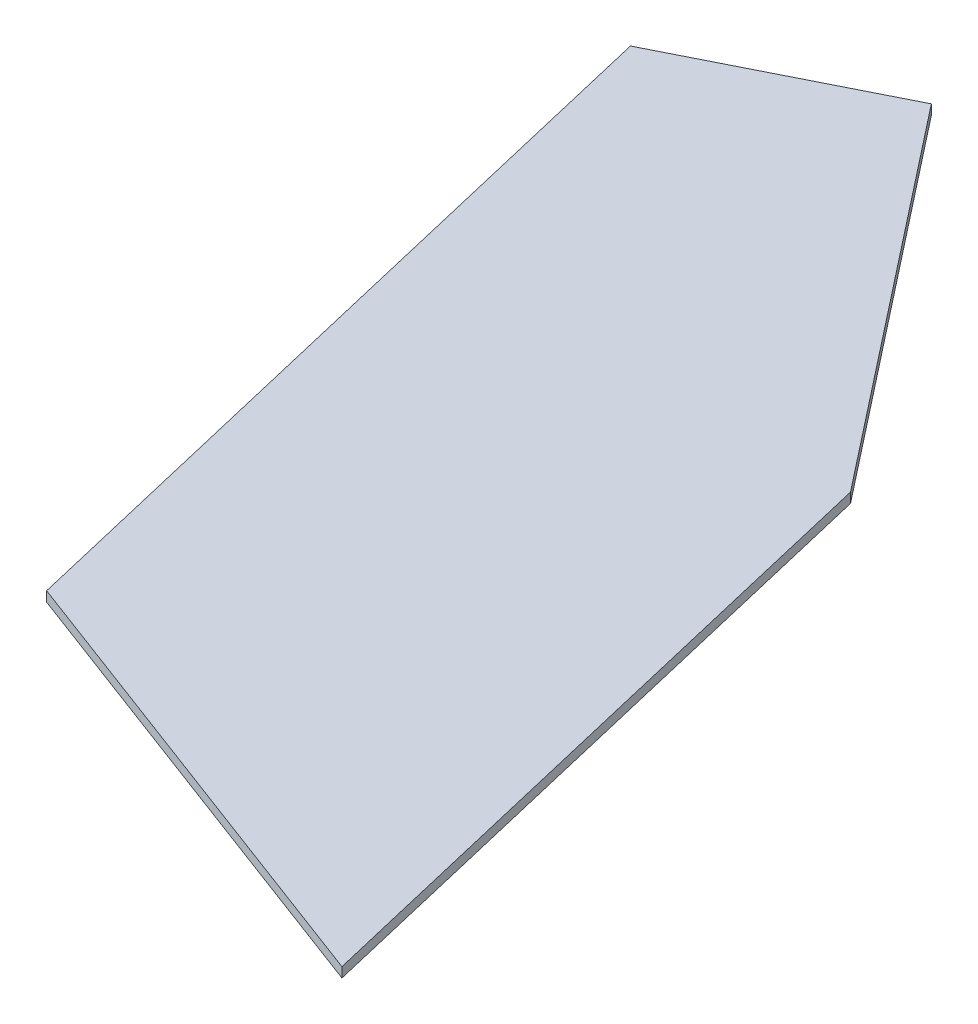
ISO-10303-21;
HEADER;
FILE_DESCRIPTION(('STEP AP214'),'2;1');
FILE_NAME('part.step','',(''),(''),'','','');
FILE_SCHEMA(('AUTOMOTIVE_DESIGN { 1 0 10303 214 1 1 1 1 }'));
ENDSEC;
DATA;
#1=APPLICATION_CONTEXT('core data for automotive mechanical design processes');
#2=APPLICATION_PROTOCOL_DEFINITION('international standard','automotive_design',2000,#1);
#3=PRODUCT_CONTEXT('',#1,'mechanical');
#4=PRODUCT('Part','Part','',(#3));
#5=PRODUCT_RELATED_PRODUCT_CATEGORY('part','',(#4));
#6=PRODUCT_DEFINITION_FORMATION('','',#4);
#7=PRODUCT_DEFINITION_CONTEXT('part definition',#1,'design');
#8=PRODUCT_DEFINITION('design','',#6,#7);
#9=PRODUCT_DEFINITION_SHAPE('','',#8);
#10=(LENGTH_UNIT() NAMED_UNIT(*) SI_UNIT(.MILLI.,.METRE.));
#11=(NAMED_UNIT(*) PLANE_ANGLE_UNIT() SI_UNIT($,.RADIAN.));
#12=(NAMED_UNIT(*) SI_UNIT($,.STERADIAN.) SOLID_ANGLE_UNIT());
#13=UNCERTAINTY_MEASURE_WITH_UNIT(LENGTH_MEASURE(1.E-05),#10,'distance_accuracy_value','');
#14=(GEOMETRIC_REPRESENTATION_CONTEXT(3) GLOBAL_UNCERTAINTY_ASSIGNED_CONTEXT((#13)) GLOBAL_UNIT_ASSIGNED_CONTEXT((#10,
#11,#12)) REPRESENTATION_CONTEXT('',''));
#15=CARTESIAN_POINT('',(0.,0.,0.));
#16=DIRECTION('',(0.,0.,1.));
#17=DIRECTION('',(1.,0.,0.));
#18=AXIS2_PLACEMENT_3D('',#15,#16,#17);
#19=CARTESIAN_POINT('',(4.19495459122454,2.,-175.36315954192));
#20=DIRECTION('',(0.447490169843808,0.,0.894288850368358));
#21=DIRECTION('',(0.894288850368358,0.,-0.447490169843808));
#22=AXIS2_PLACEMENT_3D('',#19,#20,#21);
#23=PLANE('',#22);
#24=DIRECTION('',(-0.894288850368358,0.,0.447490169843808));
#25=VECTOR('',#24,1.);
#26=CARTESIAN_POINT('',(4.19495459122454,0.,-175.36315954192));
#27=LINE('',#26,#25);
#28=CARTESIAN_POINT('',(4.19495459122454,0.,-175.36315954192));
#29=VERTEX_POINT('',#28);
#30=CARTESIAN_POINT('',(-36.5070537733269,0.,-154.996419390195));
#31=VERTEX_POINT('',#30);
#32=EDGE_CURVE('E118',#29,#31,#27,.T.);
#33=ORIENTED_EDGE('',*,*,#32,.T.);
#34=DIRECTION('',(0.,-1.,0.));
#35=VECTOR('',#34,1.);
#36=CARTESIAN_POINT('',(-36.5070537733269,2.,-154.996419390195));
#37=LINE('',#36,#35);
#38=CARTESIAN_POINT('',(-36.5070537733269,2.,-154.996419390195));
#39=VERTEX_POINT('',#38);
#40=EDGE_CURVE('E11',#39,#31,#37,.T.);
#41=ORIENTED_EDGE('',*,*,#40,.F.);
#42=DIRECTION('',(-0.894288850368358,0.,0.447490169843808));
#43=VECTOR('',#42,1.);
#44=CARTESIAN_POINT('',(4.19495459122454,2.,-175.36315954192));
#45=LINE('',#44,#43);
#46=CARTESIAN_POINT('',(4.19495459122454,2.,-175.36315954192));
#47=VERTEX_POINT('',#46);
#48=EDGE_CURVE('E131',#47,#39,#45,.T.);
#49=ORIENTED_EDGE('',*,*,#48,.F.);
#50=DIRECTION('',(0.,-1.,0.));
#51=VECTOR('',#50,1.);
#52=CARTESIAN_POINT('',(4.19495459122454,2.,-175.36315954192));
#53=LINE('',#52,#51);
#54=EDGE_CURVE('E114',#47,#29,#53,.T.);
#55=ORIENTED_EDGE('',*,*,#54,.T.);
#56=EDGE_LOOP('',(#33,#41,#49,#55));
#57=FACE_BOUND('',#56,.T.);
#58=ADVANCED_FACE('F39',(#57),#23,.F.);
#59=CARTESIAN_POINT('',(-36.5070537733269,2.,-154.996419390195));
#60=DIRECTION('',(0.973364907553881,0.,-0.229261328493546));
#61=DIRECTION('',(-0.229261328493546,0.,-0.97336490755388));
#62=AXIS2_PLACEMENT_3D('',#59,#60,#61);
#63=PLANE('',#62);
#64=DIRECTION('',(0.229261328493546,0.,0.973364907553881));
#65=VECTOR('',#64,1.);
#66=CARTESIAN_POINT('',(-36.5070537733269,0.,-154.996419390195));
#67=LINE('',#66,#65);
#68=CARTESIAN_POINT('',(0.,0.,0.));
#69=VERTEX_POINT('',#68);
#70=EDGE_CURVE('E122',#31,#69,#67,.T.);
#71=ORIENTED_EDGE('',*,*,#70,.T.);
#72=DIRECTION('',(0.,-1.,0.));
#73=VECTOR('',#72,1.);
#74=CARTESIAN_POINT('',(0.,2.,0.));
#75=LINE('',#74,#73);
#76=CARTESIAN_POINT('',(0.,2.,0.));
#77=VERTEX_POINT('',#76);
#78=EDGE_CURVE('E48',#77,#69,#75,.T.);
#79=ORIENTED_EDGE('',*,*,#78,.F.);
#80=DIRECTION('',(0.229261328493546,0.,0.973364907553881));
#81=VECTOR('',#80,1.);
#82=CARTESIAN_POINT('',(-36.5070537733269,2.,-154.996419390195));
#83=LINE('',#82,#81);
#84=EDGE_CURVE('E90',#39,#77,#83,.T.);
#85=ORIENTED_EDGE('',*,*,#84,.F.);
#86=ORIENTED_EDGE('',*,*,#40,.T.);
#87=EDGE_LOOP('',(#71,#79,#85,#86));
#88=FACE_BOUND('',#87,.T.);
#89=ADVANCED_FACE('F153',(#88),#63,.F.);
#90=CARTESIAN_POINT('',(0.,2.,0.));
#91=DIRECTION('',(0.35184830765801,0.,-0.936057032663178));
#92=DIRECTION('',(-0.936057032663178,0.,-0.35184830765801));
#93=AXIS2_PLACEMENT_3D('',#90,#91,#92);
#94=PLANE('',#93);
#95=DIRECTION('',(0.936057032663178,0.,0.35184830765801));
#96=VECTOR('',#95,1.);
#97=CARTESIAN_POINT('',(0.,0.,0.));
#98=LINE('',#97,#96);
#99=CARTESIAN_POINT('',(96.02407972049,0.,36.0938583495792));
#100=VERTEX_POINT('',#99);
#101=EDGE_CURVE('E106',#69,#100,#98,.T.);
#102=ORIENTED_EDGE('',*,*,#101,.T.);
#103=DIRECTION('',(0.,-1.,0.));
#104=VECTOR('',#103,1.);
#105=CARTESIAN_POINT('',(96.02407972049,2.,36.0938583495792));
#106=LINE('',#105,#104);
#107=CARTESIAN_POINT('',(96.02407972049,2.,36.0938583495792));
#108=VERTEX_POINT('',#107);
#109=EDGE_CURVE('E103',#108,#100,#106,.T.);
#110=ORIENTED_EDGE('',*,*,#109,.F.);
#111=DIRECTION('',(0.936057032663178,0.,0.35184830765801));
#112=VECTOR('',#111,1.);
#113=CARTESIAN_POINT('',(0.,2.,0.));
#114=LINE('',#113,#112);
#115=EDGE_CURVE('E94',#77,#108,#114,.T.);
#116=ORIENTED_EDGE('',*,*,#115,.F.);
#117=ORIENTED_EDGE('',*,*,#78,.T.);
#118=EDGE_LOOP('',(#102,#110,#116,#117));
#119=FACE_BOUND('',#118,.T.);
#120=ADVANCED_FACE('F104',(#119),#94,.F.);
#121=CARTESIAN_POINT('',(96.02407972049,2.,36.0938583495792));
#122=DIRECTION('',(-0.97336490755388,0.,0.229261328493546));
#123=DIRECTION('',(0.229261328493546,0.,0.97336490755388));
#124=AXIS2_PLACEMENT_3D('',#121,#122,#123);
#125=PLANE('',#124);
#126=DIRECTION('',(-0.229261328493546,0.,-0.973364907553881));
#127=VECTOR('',#126,1.);
#128=CARTESIAN_POINT('',(96.02407972049,0.,36.0938583495792));
#129=LINE('',#128,#127);
#130=CARTESIAN_POINT('',(64.2217942966401,0.,-98.9277295256702));
#131=VERTEX_POINT('',#130);
#132=EDGE_CURVE('E76',#100,#131,#129,.T.);
#133=ORIENTED_EDGE('',*,*,#132,.T.);
#134=DIRECTION('',(0.,-1.,0.));
#135=VECTOR('',#134,1.);
#136=CARTESIAN_POINT('',(64.2217942966401,2.,-98.9277295256702));
#137=LINE('',#136,#135);
#138=CARTESIAN_POINT('',(64.2217942966401,2.,-98.9277295256702));
#139=VERTEX_POINT('',#138);
#140=EDGE_CURVE('E108',#139,#131,#137,.T.);
#141=ORIENTED_EDGE('',*,*,#140,.F.);
#142=DIRECTION('',(-0.229261328493546,0.,-0.973364907553881));
#143=VECTOR('',#142,1.);
#144=CARTESIAN_POINT('',(96.02407972049,2.,36.0938583495792));
#145=LINE('',#144,#143);
#146=EDGE_CURVE('E98',#108,#139,#145,.T.);
#147=ORIENTED_EDGE('',*,*,#146,.F.);
#148=ORIENTED_EDGE('',*,*,#109,.T.);
#149=EDGE_LOOP('',(#133,#141,#147,#148));
#150=FACE_BOUND('',#149,.T.);
#151=ADVANCED_FACE('F110',(#150),#125,.F.);
#152=CARTESIAN_POINT('',(64.2217942966401,2.,-98.9277295256702));
#153=DIRECTION('',(-0.786466122336811,0.,0.617633417503052));
#154=DIRECTION('',(0.617633417503052,0.,0.786466122336811));
#155=AXIS2_PLACEMENT_3D('',#152,#153,#154);
#156=PLANE('',#155);
#157=DIRECTION('',(-0.617633417503052,0.,-0.786466122336811));
#158=VECTOR('',#157,1.);
#159=CARTESIAN_POINT('',(64.2217942966401,0.,-98.9277295256702));
#160=LINE('',#159,#158);
#161=EDGE_CURVE('E82',#131,#29,#160,.T.);
#162=ORIENTED_EDGE('',*,*,#161,.T.);
#163=ORIENTED_EDGE('',*,*,#54,.F.);
#164=DIRECTION('',(-0.617633417503052,0.,-0.786466122336811));
#165=VECTOR('',#164,1.);
#166=CARTESIAN_POINT('',(64.2217942966401,2.,-98.9277295256702));
#167=LINE('',#166,#165);
#168=EDGE_CURVE('E56',#139,#47,#167,.T.);
#169=ORIENTED_EDGE('',*,*,#168,.F.);
#170=ORIENTED_EDGE('',*,*,#140,.T.);
#171=EDGE_LOOP('',(#162,#163,#169,#170));
#172=FACE_BOUND('',#171,.T.);
#173=ADVANCED_FACE('F142',(#172),#156,.F.);
#174=CARTESIAN_POINT('',(0.,2.,0.));
#175=DIRECTION('',(0.,-1.,0.));
#176=DIRECTION('',(0.,0.,-1.));
#177=AXIS2_PLACEMENT_3D('',#174,#175,#176);
#178=PLANE('',#177);
#179=ORIENTED_EDGE('',*,*,#48,.T.);
#180=ORIENTED_EDGE('',*,*,#84,.T.);
#181=ORIENTED_EDGE('',*,*,#115,.T.);
#182=ORIENTED_EDGE('',*,*,#146,.T.);
#183=ORIENTED_EDGE('',*,*,#168,.T.);
#184=EDGE_LOOP('',(#179,#180,#181,#182,#183));
#185=FACE_BOUND('',#184,.T.);
#186=ADVANCED_FACE('F96',(#185),#178,.F.);
#187=CARTESIAN_POINT('',(0.,0.,0.));
#188=DIRECTION('',(0.,-1.,0.));
#189=DIRECTION('',(0.,0.,-1.));
#190=AXIS2_PLACEMENT_3D('',#187,#188,#189);
#191=PLANE('',#190);
#192=ORIENTED_EDGE('',*,*,#32,.F.);
#193=ORIENTED_EDGE('',*,*,#161,.F.);
#194=ORIENTED_EDGE('',*,*,#132,.F.);
#195=ORIENTED_EDGE('',*,*,#101,.F.);
#196=ORIENTED_EDGE('',*,*,#70,.F.);
#197=EDGE_LOOP('',(#192,#193,#194,#195,#196));
#198=FACE_BOUND('',#197,.T.);
#199=ADVANCED_FACE('F138',(#198),#191,.T.);
#200=CLOSED_SHELL('',(#58,#89,#120,#151,#173,#186,#199));
#201=MANIFOLD_SOLID_BREP('B2',#200);
#202=ADVANCED_BREP_SHAPE_REPRESENTATION('',(#18,#201),#14);
#203=SHAPE_DEFINITION_REPRESENTATION(#9,#202);
ENDSEC;
END-ISO-10303-21;
